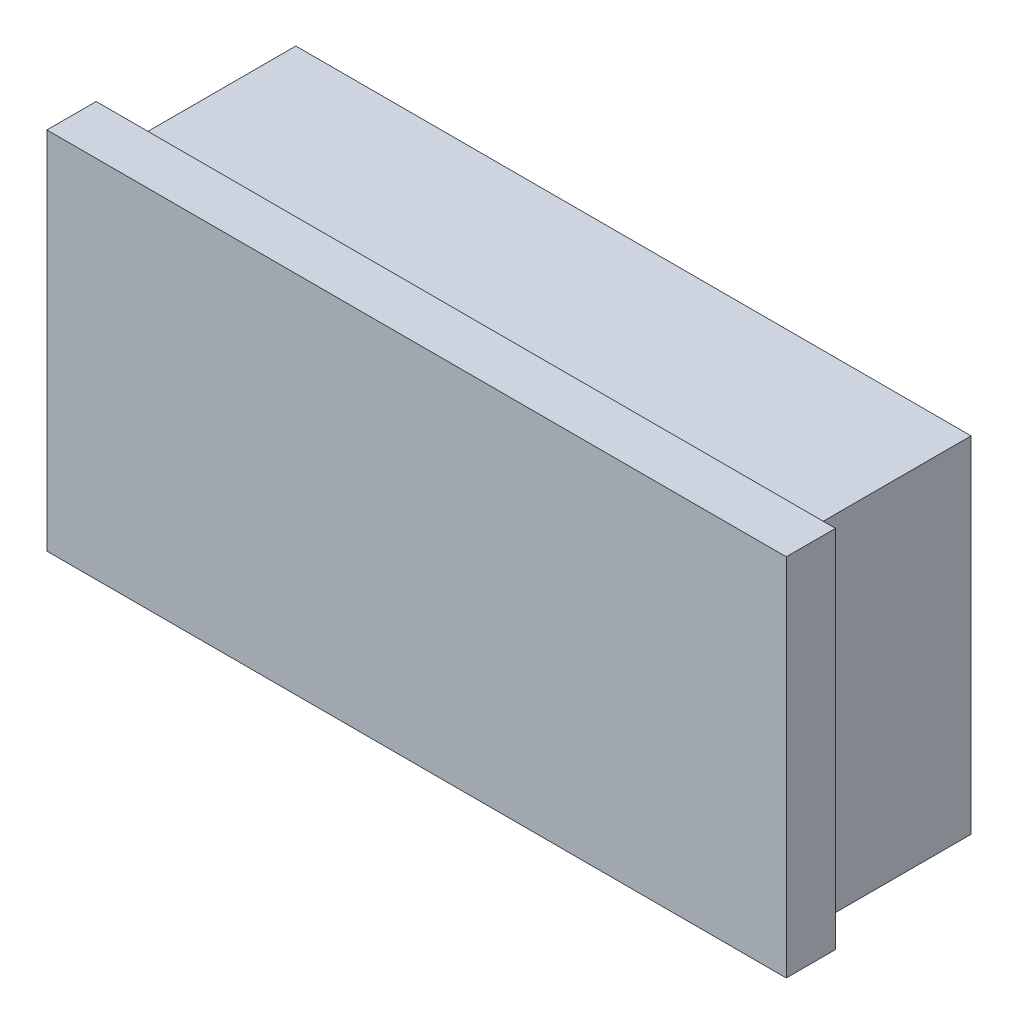
ISO-10303-21;
HEADER;
FILE_DESCRIPTION(('STEP AP214'),'2;1');
FILE_NAME('part.step','',(''),(''),'','','');
FILE_SCHEMA(('AUTOMOTIVE_DESIGN { 1 0 10303 214 1 1 1 1 }'));
ENDSEC;
DATA;
#1=APPLICATION_CONTEXT('core data for automotive mechanical design processes');
#2=APPLICATION_PROTOCOL_DEFINITION('international standard','automotive_design',2000,#1);
#3=PRODUCT_CONTEXT('',#1,'mechanical');
#4=PRODUCT('Part','Part','',(#3));
#5=PRODUCT_RELATED_PRODUCT_CATEGORY('part','',(#4));
#6=PRODUCT_DEFINITION_FORMATION('','',#4);
#7=PRODUCT_DEFINITION_CONTEXT('part definition',#1,'design');
#8=PRODUCT_DEFINITION('design','',#6,#7);
#9=PRODUCT_DEFINITION_SHAPE('','',#8);
#10=(LENGTH_UNIT() NAMED_UNIT(*) SI_UNIT(.MILLI.,.METRE.));
#11=(NAMED_UNIT(*) PLANE_ANGLE_UNIT() SI_UNIT($,.RADIAN.));
#12=(NAMED_UNIT(*) SI_UNIT($,.STERADIAN.) SOLID_ANGLE_UNIT());
#13=UNCERTAINTY_MEASURE_WITH_UNIT(LENGTH_MEASURE(1.E-05),#10,'distance_accuracy_value','');
#14=(GEOMETRIC_REPRESENTATION_CONTEXT(3) GLOBAL_UNCERTAINTY_ASSIGNED_CONTEXT((#13)) GLOBAL_UNIT_ASSIGNED_CONTEXT((#10,
#11,#12)) REPRESENTATION_CONTEXT('',''));
#15=CARTESIAN_POINT('',(0.,0.,0.));
#16=DIRECTION('',(0.,0.,1.));
#17=DIRECTION('',(1.,0.,0.));
#18=AXIS2_PLACEMENT_3D('',#15,#16,#17);
#19=CARTESIAN_POINT('',(0.,280.,176.));
#20=DIRECTION('',(0.,-1.,0.));
#21=DIRECTION('',(0.,0.,-1.));
#22=AXIS2_PLACEMENT_3D('',#19,#20,#21);
#23=PLANE('',#22);
#24=DIRECTION('',(-1.,0.,0.));
#25=VECTOR('',#24,1.);
#26=CARTESIAN_POINT('',(-26.,280.,136.));
#27=LINE('',#26,#25);
#28=CARTESIAN_POINT('',(548.,280.,136.));
#29=VERTEX_POINT('',#28);
#30=CARTESIAN_POINT('',(0.,280.,136.));
#31=VERTEX_POINT('',#30);
#32=EDGE_CURVE('E11',#29,#31,#27,.T.);
#33=ORIENTED_EDGE('',*,*,#32,.F.);
#34=DIRECTION('',(0.,0.,-1.));
#35=VECTOR('',#34,1.);
#36=CARTESIAN_POINT('',(548.,280.,176.));
#37=LINE('',#36,#35);
#38=CARTESIAN_POINT('',(548.,280.,0.));
#39=VERTEX_POINT('',#38);
#40=EDGE_CURVE('E186',#29,#39,#37,.T.);
#41=ORIENTED_EDGE('',*,*,#40,.T.);
#42=DIRECTION('',(-1.,0.,0.));
#43=VECTOR('',#42,1.);
#44=CARTESIAN_POINT('',(0.,280.,0.));
#45=LINE('',#44,#43);
#46=CARTESIAN_POINT('',(0.,280.,0.));
#47=VERTEX_POINT('',#46);
#48=EDGE_CURVE('E169',#39,#47,#45,.T.);
#49=ORIENTED_EDGE('',*,*,#48,.T.);
#50=DIRECTION('',(0.,0.,-1.));
#51=VECTOR('',#50,1.);
#52=CARTESIAN_POINT('',(0.,280.,176.));
#53=LINE('',#52,#51);
#54=EDGE_CURVE('E168',#31,#47,#53,.T.);
#55=ORIENTED_EDGE('',*,*,#54,.F.);
#56=EDGE_LOOP('',(#33,#41,#49,#55));
#57=FACE_BOUND('',#56,.T.);
#58=ADVANCED_FACE('F39',(#57),#23,.F.);
#59=CARTESIAN_POINT('',(548.,0.,176.));
#60=DIRECTION('',(-1.,0.,0.));
#61=DIRECTION('',(0.,0.,1.));
#62=AXIS2_PLACEMENT_3D('',#59,#60,#61);
#63=PLANE('',#62);
#64=DIRECTION('',(0.,1.,0.));
#65=VECTOR('',#64,1.);
#66=CARTESIAN_POINT('',(548.,280.,136.));
#67=LINE('',#66,#65);
#68=CARTESIAN_POINT('',(548.,0.,136.));
#69=VERTEX_POINT('',#68);
#70=EDGE_CURVE('E56',#69,#29,#67,.T.);
#71=ORIENTED_EDGE('',*,*,#70,.F.);
#72=DIRECTION('',(0.,0.,-1.));
#73=VECTOR('',#72,1.);
#74=CARTESIAN_POINT('',(548.,0.,176.));
#75=LINE('',#74,#73);
#76=CARTESIAN_POINT('',(548.,0.,0.));
#77=VERTEX_POINT('',#76);
#78=EDGE_CURVE('E188',#69,#77,#75,.T.);
#79=ORIENTED_EDGE('',*,*,#78,.T.);
#80=DIRECTION('',(0.,1.,0.));
#81=VECTOR('',#80,1.);
#82=CARTESIAN_POINT('',(548.,0.,0.));
#83=LINE('',#82,#81);
#84=EDGE_CURVE('E177',#77,#39,#83,.T.);
#85=ORIENTED_EDGE('',*,*,#84,.T.);
#86=ORIENTED_EDGE('',*,*,#40,.F.);
#87=EDGE_LOOP('',(#71,#79,#85,#86));
#88=FACE_BOUND('',#87,.T.);
#89=ADVANCED_FACE('F203',(#88),#63,.F.);
#90=CARTESIAN_POINT('',(0.,0.,176.));
#91=DIRECTION('',(1.,0.,0.));
#92=DIRECTION('',(0.,0.,-1.));
#93=AXIS2_PLACEMENT_3D('',#90,#91,#92);
#94=PLANE('',#93);
#95=DIRECTION('',(0.,-1.,0.));
#96=VECTOR('',#95,1.);
#97=CARTESIAN_POINT('',(0.,0.,136.));
#98=LINE('',#97,#96);
#99=CARTESIAN_POINT('',(0.,0.,136.));
#100=VERTEX_POINT('',#99);
#101=EDGE_CURVE('E116',#31,#100,#98,.T.);
#102=ORIENTED_EDGE('',*,*,#101,.F.);
#103=ORIENTED_EDGE('',*,*,#54,.T.);
#104=DIRECTION('',(0.,-1.,0.));
#105=VECTOR('',#104,1.);
#106=CARTESIAN_POINT('',(0.,0.,0.));
#107=LINE('',#106,#105);
#108=CARTESIAN_POINT('',(0.,0.,0.));
#109=VERTEX_POINT('',#108);
#110=EDGE_CURVE('E164',#47,#109,#107,.T.);
#111=ORIENTED_EDGE('',*,*,#110,.T.);
#112=DIRECTION('',(0.,0.,-1.));
#113=VECTOR('',#112,1.);
#114=CARTESIAN_POINT('',(0.,0.,176.));
#115=LINE('',#114,#113);
#116=EDGE_CURVE('E43',#100,#109,#115,.T.);
#117=ORIENTED_EDGE('',*,*,#116,.F.);
#118=EDGE_LOOP('',(#102,#103,#111,#117));
#119=FACE_BOUND('',#118,.T.);
#120=ADVANCED_FACE('F41',(#119),#94,.F.);
#121=CARTESIAN_POINT('',(0.,0.,176.));
#122=DIRECTION('',(0.,1.,0.));
#123=DIRECTION('',(0.,0.,1.));
#124=AXIS2_PLACEMENT_3D('',#121,#122,#123);
#125=PLANE('',#124);
#126=DIRECTION('',(1.,0.,0.));
#127=VECTOR('',#126,1.);
#128=CARTESIAN_POINT('',(0.,0.,0.));
#129=LINE('',#128,#127);
#130=EDGE_CURVE('E173',#109,#77,#129,.T.);
#131=ORIENTED_EDGE('',*,*,#130,.T.);
#132=ORIENTED_EDGE('',*,*,#78,.F.);
#133=DIRECTION('',(-1.,0.,0.));
#134=VECTOR('',#133,1.);
#135=CARTESIAN_POINT('',(574.,0.,136.));
#136=LINE('',#135,#134);
#137=CARTESIAN_POINT('',(574.,0.,136.));
#138=VERTEX_POINT('',#137);
#139=EDGE_CURVE('E148',#138,#69,#136,.T.);
#140=ORIENTED_EDGE('',*,*,#139,.F.);
#141=DIRECTION('',(0.,0.,-1.));
#142=VECTOR('',#141,1.);
#143=CARTESIAN_POINT('',(574.,0.,176.));
#144=LINE('',#143,#142);
#145=CARTESIAN_POINT('',(574.,0.,176.));
#146=VERTEX_POINT('',#145);
#147=EDGE_CURVE('E142',#146,#138,#144,.T.);
#148=ORIENTED_EDGE('',*,*,#147,.F.);
#149=DIRECTION('',(1.,0.,0.));
#150=VECTOR('',#149,1.);
#151=CARTESIAN_POINT('',(0.,0.,176.));
#152=LINE('',#151,#150);
#153=CARTESIAN_POINT('',(-26.,0.,176.));
#154=VERTEX_POINT('',#153);
#155=EDGE_CURVE('E165',#154,#146,#152,.T.);
#156=ORIENTED_EDGE('',*,*,#155,.F.);
#157=DIRECTION('',(0.,0.,1.));
#158=VECTOR('',#157,1.);
#159=CARTESIAN_POINT('',(-26.,0.,176.));
#160=LINE('',#159,#158);
#161=CARTESIAN_POINT('',(-26.,0.,136.));
#162=VERTEX_POINT('',#161);
#163=EDGE_CURVE('E112',#162,#154,#160,.T.);
#164=ORIENTED_EDGE('',*,*,#163,.F.);
#165=DIRECTION('',(1.,0.,0.));
#166=VECTOR('',#165,1.);
#167=CARTESIAN_POINT('',(-26.,0.,136.));
#168=LINE('',#167,#166);
#169=EDGE_CURVE('E158',#162,#100,#168,.T.);
#170=ORIENTED_EDGE('',*,*,#169,.T.);
#171=ORIENTED_EDGE('',*,*,#116,.T.);
#172=EDGE_LOOP('',(#131,#132,#140,#148,#156,#164,#170,#171));
#173=FACE_BOUND('',#172,.T.);
#174=ADVANCED_FACE('F193',(#173),#125,.F.);
#175=CARTESIAN_POINT('',(0.,0.,176.));
#176=DIRECTION('',(0.,0.,-1.));
#177=DIRECTION('',(-1.,0.,0.));
#178=AXIS2_PLACEMENT_3D('',#175,#176,#177);
#179=PLANE('',#178);
#180=DIRECTION('',(0.,-1.,0.));
#181=VECTOR('',#180,1.);
#182=CARTESIAN_POINT('',(574.,280.,176.));
#183=LINE('',#182,#181);
#184=CARTESIAN_POINT('',(574.,296.,176.));
#185=VERTEX_POINT('',#184);
#186=EDGE_CURVE('E122',#185,#146,#183,.T.);
#187=ORIENTED_EDGE('',*,*,#186,.F.);
#188=DIRECTION('',(1.,0.,0.));
#189=VECTOR('',#188,1.);
#190=CARTESIAN_POINT('',(-26.,296.,176.));
#191=LINE('',#190,#189);
#192=CARTESIAN_POINT('',(-26.,296.,176.));
#193=VERTEX_POINT('',#192);
#194=EDGE_CURVE('E119',#193,#185,#191,.T.);
#195=ORIENTED_EDGE('',*,*,#194,.F.);
#196=DIRECTION('',(0.,1.,0.));
#197=VECTOR('',#196,1.);
#198=CARTESIAN_POINT('',(-26.,0.,176.));
#199=LINE('',#198,#197);
#200=EDGE_CURVE('E106',#154,#193,#199,.T.);
#201=ORIENTED_EDGE('',*,*,#200,.F.);
#202=ORIENTED_EDGE('',*,*,#155,.T.);
#203=EDGE_LOOP('',(#187,#195,#201,#202));
#204=FACE_BOUND('',#203,.T.);
#205=ADVANCED_FACE('F120',(#204),#179,.F.);
#206=CARTESIAN_POINT('',(0.,0.,0.));
#207=DIRECTION('',(0.,0.,-1.));
#208=DIRECTION('',(-1.,0.,0.));
#209=AXIS2_PLACEMENT_3D('',#206,#207,#208);
#210=PLANE('',#209);
#211=ORIENTED_EDGE('',*,*,#110,.F.);
#212=ORIENTED_EDGE('',*,*,#48,.F.);
#213=ORIENTED_EDGE('',*,*,#84,.F.);
#214=ORIENTED_EDGE('',*,*,#130,.F.);
#215=EDGE_LOOP('',(#211,#212,#213,#214));
#216=FACE_BOUND('',#215,.T.);
#217=ADVANCED_FACE('F199',(#216),#210,.T.);
#218=CARTESIAN_POINT('',(-26.,0.,136.));
#219=DIRECTION('',(0.,0.,1.));
#220=DIRECTION('',(1.,0.,0.));
#221=AXIS2_PLACEMENT_3D('',#218,#219,#220);
#222=PLANE('',#221);
#223=ORIENTED_EDGE('',*,*,#101,.T.);
#224=ORIENTED_EDGE('',*,*,#169,.F.);
#225=DIRECTION('',(0.,-1.,0.));
#226=VECTOR('',#225,1.);
#227=CARTESIAN_POINT('',(-26.,0.,136.));
#228=LINE('',#227,#226);
#229=CARTESIAN_POINT('',(-26.,296.,136.));
#230=VERTEX_POINT('',#229);
#231=EDGE_CURVE('E115',#230,#162,#228,.T.);
#232=ORIENTED_EDGE('',*,*,#231,.F.);
#233=DIRECTION('',(-1.,0.,0.));
#234=VECTOR('',#233,1.);
#235=CARTESIAN_POINT('',(-26.,296.,136.));
#236=LINE('',#235,#234);
#237=CARTESIAN_POINT('',(574.,296.,136.));
#238=VERTEX_POINT('',#237);
#239=EDGE_CURVE('E132',#238,#230,#236,.T.);
#240=ORIENTED_EDGE('',*,*,#239,.F.);
#241=DIRECTION('',(0.,1.,0.));
#242=VECTOR('',#241,1.);
#243=CARTESIAN_POINT('',(574.,280.,136.));
#244=LINE('',#243,#242);
#245=EDGE_CURVE('E145',#138,#238,#244,.T.);
#246=ORIENTED_EDGE('',*,*,#245,.F.);
#247=ORIENTED_EDGE('',*,*,#139,.T.);
#248=ORIENTED_EDGE('',*,*,#70,.T.);
#249=ORIENTED_EDGE('',*,*,#32,.T.);
#250=EDGE_LOOP('',(#223,#224,#232,#240,#246,#247,#248,#249));
#251=FACE_BOUND('',#250,.T.);
#252=ADVANCED_FACE('F220',(#251),#222,.F.);
#253=CARTESIAN_POINT('',(-26.,0.,0.));
#254=DIRECTION('',(-1.,0.,0.));
#255=DIRECTION('',(0.,0.,1.));
#256=AXIS2_PLACEMENT_3D('',#253,#254,#255);
#257=PLANE('',#256);
#258=ORIENTED_EDGE('',*,*,#200,.T.);
#259=DIRECTION('',(0.,0.,1.));
#260=VECTOR('',#259,1.);
#261=CARTESIAN_POINT('',(-26.,296.,136.));
#262=LINE('',#261,#260);
#263=EDGE_CURVE('E110',#230,#193,#262,.T.);
#264=ORIENTED_EDGE('',*,*,#263,.F.);
#265=ORIENTED_EDGE('',*,*,#231,.T.);
#266=ORIENTED_EDGE('',*,*,#163,.T.);
#267=EDGE_LOOP('',(#258,#264,#265,#266));
#268=FACE_BOUND('',#267,.T.);
#269=ADVANCED_FACE('F108',(#268),#257,.T.);
#270=CARTESIAN_POINT('',(574.,0.,0.));
#271=DIRECTION('',(1.,0.,0.));
#272=DIRECTION('',(0.,0.,-1.));
#273=AXIS2_PLACEMENT_3D('',#270,#271,#272);
#274=PLANE('',#273);
#275=ORIENTED_EDGE('',*,*,#186,.T.);
#276=ORIENTED_EDGE('',*,*,#147,.T.);
#277=ORIENTED_EDGE('',*,*,#245,.T.);
#278=DIRECTION('',(0.,0.,-1.));
#279=VECTOR('',#278,1.);
#280=CARTESIAN_POINT('',(574.,296.,136.));
#281=LINE('',#280,#279);
#282=EDGE_CURVE('E127',#185,#238,#281,.T.);
#283=ORIENTED_EDGE('',*,*,#282,.F.);
#284=EDGE_LOOP('',(#275,#276,#277,#283));
#285=FACE_BOUND('',#284,.T.);
#286=ADVANCED_FACE('F226',(#285),#274,.T.);
#287=CARTESIAN_POINT('',(0.,296.,0.));
#288=DIRECTION('',(0.,1.,0.));
#289=DIRECTION('',(0.,0.,1.));
#290=AXIS2_PLACEMENT_3D('',#287,#288,#289);
#291=PLANE('',#290);
#292=ORIENTED_EDGE('',*,*,#263,.T.);
#293=ORIENTED_EDGE('',*,*,#194,.T.);
#294=ORIENTED_EDGE('',*,*,#282,.T.);
#295=ORIENTED_EDGE('',*,*,#239,.T.);
#296=EDGE_LOOP('',(#292,#293,#294,#295));
#297=FACE_BOUND('',#296,.T.);
#298=ADVANCED_FACE('F130',(#297),#291,.T.);
#299=CLOSED_SHELL('',(#58,#89,#120,#174,#205,#217,#252,#269,#286,#298));
#300=MANIFOLD_SOLID_BREP('B2',#299);
#301=ADVANCED_BREP_SHAPE_REPRESENTATION('',(#18,#300),#14);
#302=SHAPE_DEFINITION_REPRESENTATION(#9,#301);
ENDSEC;
END-ISO-10303-21;
